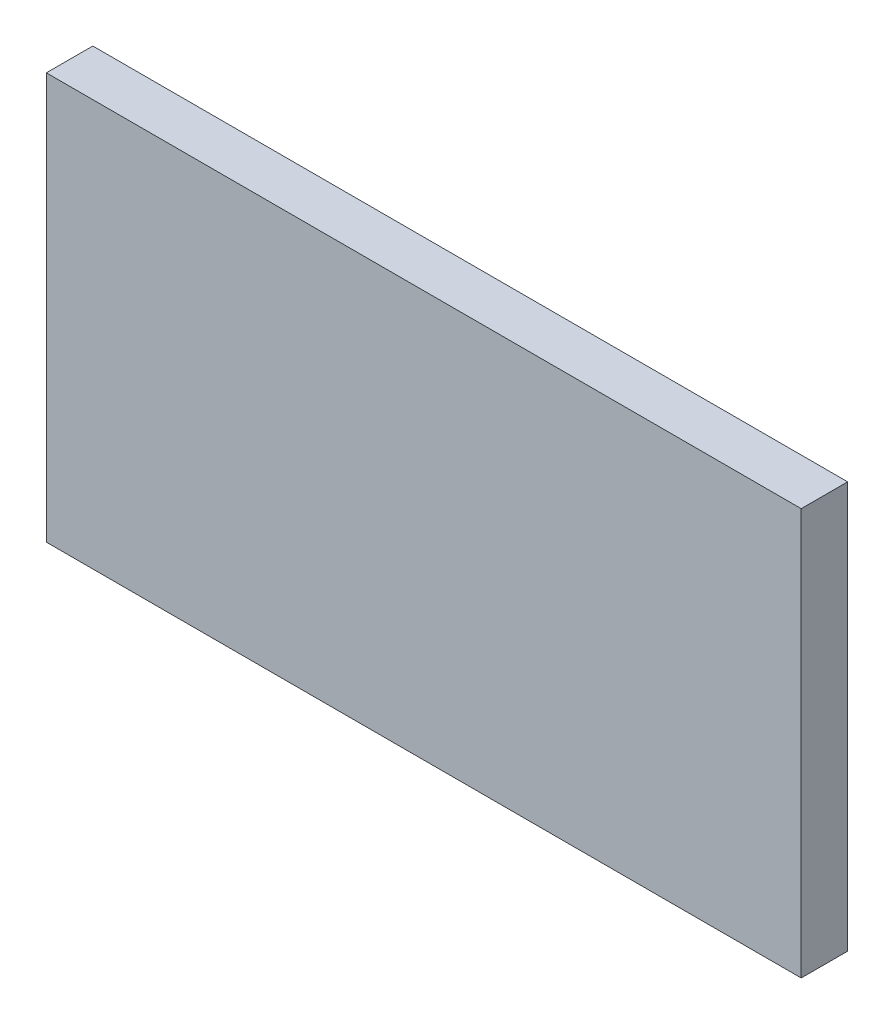
ISO-10303-21;
HEADER;
FILE_DESCRIPTION(('STEP AP214'),'2;1');
FILE_NAME('part.step','',(''),(''),'','','');
FILE_SCHEMA(('AUTOMOTIVE_DESIGN { 1 0 10303 214 1 1 1 1 }'));
ENDSEC;
DATA;
#1=APPLICATION_CONTEXT('core data for automotive mechanical design processes');
#2=APPLICATION_PROTOCOL_DEFINITION('international standard','automotive_design',2000,#1);
#3=PRODUCT_CONTEXT('',#1,'mechanical');
#4=PRODUCT('Part','Part','',(#3));
#5=PRODUCT_RELATED_PRODUCT_CATEGORY('part','',(#4));
#6=PRODUCT_DEFINITION_FORMATION('','',#4);
#7=PRODUCT_DEFINITION_CONTEXT('part definition',#1,'design');
#8=PRODUCT_DEFINITION('design','',#6,#7);
#9=PRODUCT_DEFINITION_SHAPE('','',#8);
#10=(LENGTH_UNIT() NAMED_UNIT(*) SI_UNIT(.MILLI.,.METRE.));
#11=(NAMED_UNIT(*) PLANE_ANGLE_UNIT() SI_UNIT($,.RADIAN.));
#12=(NAMED_UNIT(*) SI_UNIT($,.STERADIAN.) SOLID_ANGLE_UNIT());
#13=UNCERTAINTY_MEASURE_WITH_UNIT(LENGTH_MEASURE(1.E-05),#10,'distance_accuracy_value','');
#14=(GEOMETRIC_REPRESENTATION_CONTEXT(3) GLOBAL_UNCERTAINTY_ASSIGNED_CONTEXT((#13)) GLOBAL_UNIT_ASSIGNED_CONTEXT((#10,
#11,#12)) REPRESENTATION_CONTEXT('',''));
#15=CARTESIAN_POINT('',(0.,0.,0.));
#16=DIRECTION('',(0.,0.,1.));
#17=DIRECTION('',(1.,0.,0.));
#18=AXIS2_PLACEMENT_3D('',#15,#16,#17);
#19=CARTESIAN_POINT('',(-65.,35.,8.));
#20=DIRECTION('',(1.,0.,0.));
#21=DIRECTION('',(0.,1.,0.));
#22=AXIS2_PLACEMENT_3D('',#19,#20,#21);
#23=PLANE('',#22);
#24=DIRECTION('',(0.,-1.,0.));
#25=VECTOR('',#24,1.);
#26=CARTESIAN_POINT('',(-65.,35.,0.));
#27=LINE('',#26,#25);
#28=CARTESIAN_POINT('',(-65.,35.,0.));
#29=VERTEX_POINT('',#28);
#30=CARTESIAN_POINT('',(-65.,-35.,0.));
#31=VERTEX_POINT('',#30);
#32=EDGE_CURVE('E96',#29,#31,#27,.T.);
#33=ORIENTED_EDGE('',*,*,#32,.T.);
#34=DIRECTION('',(0.,0.,-1.));
#35=VECTOR('',#34,1.);
#36=CARTESIAN_POINT('',(-65.,-35.,8.));
#37=LINE('',#36,#35);
#38=CARTESIAN_POINT('',(-65.,-35.,8.));
#39=VERTEX_POINT('',#38);
#40=EDGE_CURVE('E11',#39,#31,#37,.T.);
#41=ORIENTED_EDGE('',*,*,#40,.F.);
#42=DIRECTION('',(0.,-1.,0.));
#43=VECTOR('',#42,1.);
#44=CARTESIAN_POINT('',(-65.,35.,8.));
#45=LINE('',#44,#43);
#46=CARTESIAN_POINT('',(-65.,35.,8.));
#47=VERTEX_POINT('',#46);
#48=EDGE_CURVE('E84',#47,#39,#45,.T.);
#49=ORIENTED_EDGE('',*,*,#48,.F.);
#50=DIRECTION('',(0.,0.,-1.));
#51=VECTOR('',#50,1.);
#52=CARTESIAN_POINT('',(-65.,35.,8.));
#53=LINE('',#52,#51);
#54=EDGE_CURVE('E92',#47,#29,#53,.T.);
#55=ORIENTED_EDGE('',*,*,#54,.T.);
#56=EDGE_LOOP('',(#33,#41,#49,#55));
#57=FACE_BOUND('',#56,.T.);
#58=ADVANCED_FACE('F33',(#57),#23,.F.);
#59=CARTESIAN_POINT('',(65.,-35.,8.));
#60=DIRECTION('',(0.,1.,0.));
#61=DIRECTION('',(-1.,0.,0.));
#62=AXIS2_PLACEMENT_3D('',#59,#60,#61);
#63=PLANE('',#62);
#64=DIRECTION('',(1.,0.,0.));
#65=VECTOR('',#64,1.);
#66=CARTESIAN_POINT('',(65.,-35.,0.));
#67=LINE('',#66,#65);
#68=CARTESIAN_POINT('',(65.,-35.,0.));
#69=VERTEX_POINT('',#68);
#70=EDGE_CURVE('E88',#31,#69,#67,.T.);
#71=ORIENTED_EDGE('',*,*,#70,.T.);
#72=DIRECTION('',(0.,0.,-1.));
#73=VECTOR('',#72,1.);
#74=CARTESIAN_POINT('',(65.,-35.,8.));
#75=LINE('',#74,#73);
#76=CARTESIAN_POINT('',(65.,-35.,8.));
#77=VERTEX_POINT('',#76);
#78=EDGE_CURVE('E41',#77,#69,#75,.T.);
#79=ORIENTED_EDGE('',*,*,#78,.F.);
#80=DIRECTION('',(1.,0.,0.));
#81=VECTOR('',#80,1.);
#82=CARTESIAN_POINT('',(65.,-35.,8.));
#83=LINE('',#82,#81);
#84=EDGE_CURVE('E79',#39,#77,#83,.T.);
#85=ORIENTED_EDGE('',*,*,#84,.F.);
#86=ORIENTED_EDGE('',*,*,#40,.T.);
#87=EDGE_LOOP('',(#71,#79,#85,#86));
#88=FACE_BOUND('',#87,.T.);
#89=ADVANCED_FACE('F87',(#88),#63,.F.);
#90=CARTESIAN_POINT('',(65.,35.,8.));
#91=DIRECTION('',(-1.,0.,0.));
#92=DIRECTION('',(0.,0.,1.));
#93=AXIS2_PLACEMENT_3D('',#90,#91,#92);
#94=PLANE('',#93);
#95=DIRECTION('',(0.,1.,0.));
#96=VECTOR('',#95,1.);
#97=CARTESIAN_POINT('',(65.,35.,0.));
#98=LINE('',#97,#96);
#99=CARTESIAN_POINT('',(65.,35.,0.));
#100=VERTEX_POINT('',#99);
#101=EDGE_CURVE('E66',#69,#100,#98,.T.);
#102=ORIENTED_EDGE('',*,*,#101,.T.);
#103=DIRECTION('',(0.,0.,-1.));
#104=VECTOR('',#103,1.);
#105=CARTESIAN_POINT('',(65.,35.,8.));
#106=LINE('',#105,#104);
#107=CARTESIAN_POINT('',(65.,35.,8.));
#108=VERTEX_POINT('',#107);
#109=EDGE_CURVE('E89',#108,#100,#106,.T.);
#110=ORIENTED_EDGE('',*,*,#109,.F.);
#111=DIRECTION('',(0.,1.,0.));
#112=VECTOR('',#111,1.);
#113=CARTESIAN_POINT('',(65.,35.,8.));
#114=LINE('',#113,#112);
#115=EDGE_CURVE('E82',#77,#108,#114,.T.);
#116=ORIENTED_EDGE('',*,*,#115,.F.);
#117=ORIENTED_EDGE('',*,*,#78,.T.);
#118=EDGE_LOOP('',(#102,#110,#116,#117));
#119=FACE_BOUND('',#118,.T.);
#120=ADVANCED_FACE('F90',(#119),#94,.F.);
#121=CARTESIAN_POINT('',(65.,35.,8.));
#122=DIRECTION('',(0.,-1.,0.));
#123=DIRECTION('',(1.,0.,0.));
#124=AXIS2_PLACEMENT_3D('',#121,#122,#123);
#125=PLANE('',#124);
#126=DIRECTION('',(-1.,0.,0.));
#127=VECTOR('',#126,1.);
#128=CARTESIAN_POINT('',(65.,35.,0.));
#129=LINE('',#128,#127);
#130=EDGE_CURVE('E72',#100,#29,#129,.T.);
#131=ORIENTED_EDGE('',*,*,#130,.T.);
#132=ORIENTED_EDGE('',*,*,#54,.F.);
#133=DIRECTION('',(-1.,0.,0.));
#134=VECTOR('',#133,1.);
#135=CARTESIAN_POINT('',(65.,35.,8.));
#136=LINE('',#135,#134);
#137=EDGE_CURVE('E49',#108,#47,#136,.T.);
#138=ORIENTED_EDGE('',*,*,#137,.F.);
#139=ORIENTED_EDGE('',*,*,#109,.T.);
#140=EDGE_LOOP('',(#131,#132,#138,#139));
#141=FACE_BOUND('',#140,.T.);
#142=ADVANCED_FACE('F103',(#141),#125,.F.);
#143=CARTESIAN_POINT('',(0.,0.,8.));
#144=DIRECTION('',(0.,0.,-1.));
#145=DIRECTION('',(-1.,0.,0.));
#146=AXIS2_PLACEMENT_3D('',#143,#144,#145);
#147=PLANE('',#146);
#148=ORIENTED_EDGE('',*,*,#48,.T.);
#149=ORIENTED_EDGE('',*,*,#84,.T.);
#150=ORIENTED_EDGE('',*,*,#115,.T.);
#151=ORIENTED_EDGE('',*,*,#137,.T.);
#152=EDGE_LOOP('',(#148,#149,#150,#151));
#153=FACE_BOUND('',#152,.T.);
#154=ADVANCED_FACE('F80',(#153),#147,.F.);
#155=CARTESIAN_POINT('',(0.,0.,0.));
#156=DIRECTION('',(0.,0.,-1.));
#157=DIRECTION('',(-1.,0.,0.));
#158=AXIS2_PLACEMENT_3D('',#155,#156,#157);
#159=PLANE('',#158);
#160=ORIENTED_EDGE('',*,*,#32,.F.);
#161=ORIENTED_EDGE('',*,*,#130,.F.);
#162=ORIENTED_EDGE('',*,*,#101,.F.);
#163=ORIENTED_EDGE('',*,*,#70,.F.);
#164=EDGE_LOOP('',(#160,#161,#162,#163));
#165=FACE_BOUND('',#164,.T.);
#166=ADVANCED_FACE('F106',(#165),#159,.T.);
#167=CLOSED_SHELL('',(#58,#89,#120,#142,#154,#166));
#168=MANIFOLD_SOLID_BREP('B2',#167);
#169=ADVANCED_BREP_SHAPE_REPRESENTATION('',(#18,#168),#14);
#170=SHAPE_DEFINITION_REPRESENTATION(#9,#169);
ENDSEC;
END-ISO-10303-21;
